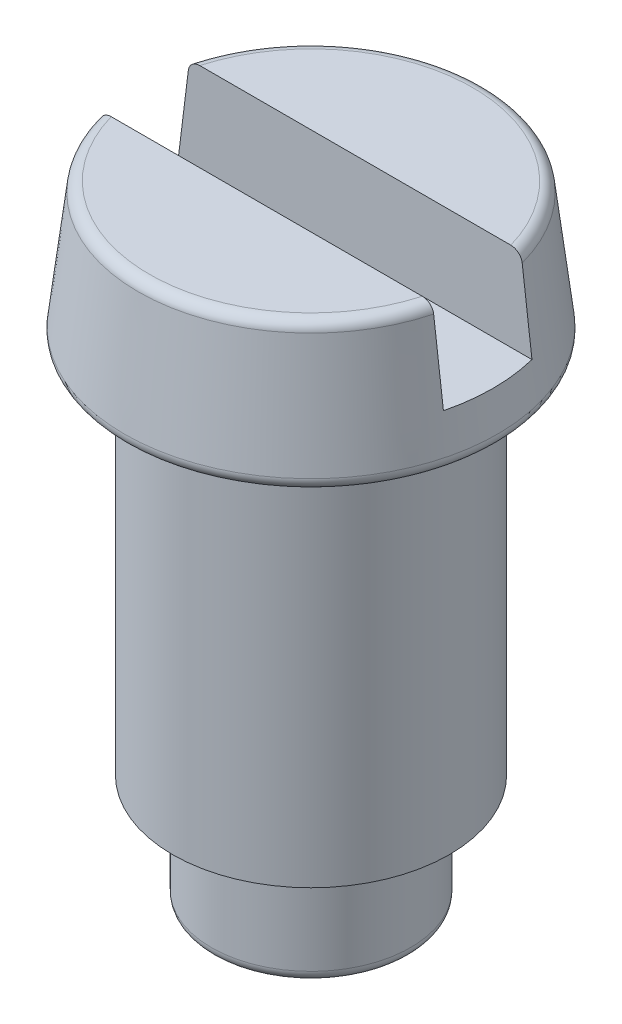
ISO-10303-21;
HEADER;
FILE_DESCRIPTION(('STEP AP214'),'2;1');
FILE_NAME('part.step','',(''),(''),'','','');
FILE_SCHEMA(('AUTOMOTIVE_DESIGN { 1 0 10303 214 1 1 1 1 }'));
ENDSEC;
DATA;
#1=APPLICATION_CONTEXT('core data for automotive mechanical design processes');
#2=APPLICATION_PROTOCOL_DEFINITION('international standard','automotive_design',2000,#1);
#3=PRODUCT_CONTEXT('',#1,'mechanical');
#4=PRODUCT('Part','Part','',(#3));
#5=PRODUCT_RELATED_PRODUCT_CATEGORY('part','',(#4));
#6=PRODUCT_DEFINITION_FORMATION('','',#4);
#7=PRODUCT_DEFINITION_CONTEXT('part definition',#1,'design');
#8=PRODUCT_DEFINITION('design','',#6,#7);
#9=PRODUCT_DEFINITION_SHAPE('','',#8);
#10=(LENGTH_UNIT() NAMED_UNIT(*) SI_UNIT(.MILLI.,.METRE.));
#11=(NAMED_UNIT(*) PLANE_ANGLE_UNIT() SI_UNIT($,.RADIAN.));
#12=(NAMED_UNIT(*) SI_UNIT($,.STERADIAN.) SOLID_ANGLE_UNIT());
#13=UNCERTAINTY_MEASURE_WITH_UNIT(LENGTH_MEASURE(1.E-05),#10,'distance_accuracy_value','');
#14=(GEOMETRIC_REPRESENTATION_CONTEXT(3) GLOBAL_UNCERTAINTY_ASSIGNED_CONTEXT((#13)) GLOBAL_UNIT_ASSIGNED_CONTEXT((#10,
#11,#12)) REPRESENTATION_CONTEXT('',''));
#15=CARTESIAN_POINT('',(0.,0.,0.));
#16=DIRECTION('',(0.,0.,1.));
#17=DIRECTION('',(1.,0.,0.));
#18=AXIS2_PLACEMENT_3D('',#15,#16,#17);
#19=CARTESIAN_POINT('',(0.,4.85,0.));
#20=DIRECTION('',(0.,-1.,0.));
#21=DIRECTION('',(0.,0.,-1.));
#22=AXIS2_PLACEMENT_3D('',#19,#20,#21);
#23=PLANE('',#22);
#24=CARTESIAN_POINT('',(0.,4.84999999997626,0.));
#25=DIRECTION('',(0.,-1.,0.));
#26=DIRECTION('',(0.,0.,-1.));
#27=AXIS2_PLACEMENT_3D('',#24,#25,#26);
#28=CIRCLE('',#27,1.64600000000177);
#29=CARTESIAN_POINT('',(-1.59665775919641,4.8499999999857,0.4));
#30=VERTEX_POINT('',#29);
#31=CARTESIAN_POINT('',(-1.59665775919611,4.84999999998813,-0.4));
#32=VERTEX_POINT('',#31);
#33=EDGE_CURVE('E98',#30,#32,#28,.T.);
#34=ORIENTED_EDGE('',*,*,#33,.F.);
#35=DIRECTION('',(1.,0.,0.));
#36=VECTOR('',#35,1.);
#37=CARTESIAN_POINT('',(-1.768147519559,4.85,0.4));
#38=LINE('',#37,#36);
#39=CARTESIAN_POINT('',(1.59665775919611,4.84999999998813,0.4));
#40=VERTEX_POINT('',#39);
#41=EDGE_CURVE('E96',#30,#40,#38,.T.);
#42=ORIENTED_EDGE('',*,*,#41,.T.);
#43=CARTESIAN_POINT('',(0.,4.84999999997626,0.));
#44=DIRECTION('',(0.,-1.,0.));
#45=DIRECTION('',(0.,0.,-1.));
#46=AXIS2_PLACEMENT_3D('',#43,#44,#45);
#47=CIRCLE('',#46,1.64600000000177);
#48=CARTESIAN_POINT('',(1.59665775919641,4.8499999999857,-0.4));
#49=VERTEX_POINT('',#48);
#50=EDGE_CURVE('E19',#49,#40,#47,.T.);
#51=ORIENTED_EDGE('',*,*,#50,.F.);
#52=DIRECTION('',(-1.,0.,0.));
#53=VECTOR('',#52,1.);
#54=CARTESIAN_POINT('',(-1.768147519559,4.85,-0.4));
#55=LINE('',#54,#53);
#56=EDGE_CURVE('E88',#49,#32,#55,.T.);
#57=ORIENTED_EDGE('',*,*,#56,.T.);
#58=EDGE_LOOP('',(#34,#42,#51,#57));
#59=FACE_BOUND('',#58,.T.);
#60=ADVANCED_FACE('F16',(#59),#23,.F.);
#61=CARTESIAN_POINT('',(-1.768147519559,4.85,-0.4));
#62=DIRECTION('',(0.,0.,-1.));
#63=DIRECTION('',(-1.,0.,0.));
#64=AXIS2_PLACEMENT_3D('',#61,#62,#63);
#65=PLANE('',#64);
#66=CARTESIAN_POINT('',(1.5084361200041,5.56191452205894,-0.4));
#67=CARTESIAN_POINT('',(1.52316535532603,5.4432652776401,-0.4));
#68=CARTESIAN_POINT('',(1.53788177625521,5.32461444524026,-0.4));
#69=CARTESIAN_POINT('',(1.56728898931891,5.08730960455233,-0.4));
#70=CARTESIAN_POINT('',(1.58197978145345,4.96865559626424,-0.4));
#71=CARTESIAN_POINT('',(1.59665775919524,4.84999999999515,-0.4));
#72=B_SPLINE_CURVE_WITH_KNOTS('',3,(#66,#67,#68,#69,#70,#71),.UNSPECIFIED.,.F.,.F.,(4,2,4),(0.,
0.358679993402551,0.717359986582176),.UNSPECIFIED.);
#73=CARTESIAN_POINT('',(1.50843612000506,5.56191452205329,-0.4));
#74=VERTEX_POINT('',#73);
#75=EDGE_CURVE('E79',#74,#49,#72,.T.);
#76=ORIENTED_EDGE('',*,*,#75,.F.);
#77=CARTESIAN_POINT('',(1.40547029837921,5.65,-0.4));
#78=CARTESIAN_POINT('',(1.41147922968689,5.64999822856031,-0.400000000000154));
#79=CARTESIAN_POINT('',(1.41747791170112,5.64949739913765,-0.400000000000156));
#80=CARTESIAN_POINT('',(1.4293114630653,5.64750523172282,-0.399999999999844));
#81=CARTESIAN_POINT('',(1.43514623903793,5.64601334059016,-0.399999999999529));
#82=CARTESIAN_POINT('',(1.45214451965364,5.64007550016679,-0.399999999998095));
#83=CARTESIAN_POINT('',(1.46284061760868,5.63416725771965,-0.399999999996488));
#84=CARTESIAN_POINT('',(1.48133936764325,5.61920015614898,-0.399999999994457));
#85=CARTESIAN_POINT('',(1.48919823231907,5.61021029812244,-0.399999999994009));
#86=CARTESIAN_POINT('',(1.50107820419689,5.59035966043989,-0.399999999989531));
#87=CARTESIAN_POINT('',(1.50522507473134,5.57957619011118,-0.399999999985627));
#88=CARTESIAN_POINT('',(1.50781693035836,5.56629862848649,-0.39999999999533));
#89=CARTESIAN_POINT('',(1.50816568266591,5.56410997100173,-0.399999999997382));
#90=CARTESIAN_POINT('',(1.50843612000461,5.561914522059,-0.4));
#91=B_SPLINE_CURVE_WITH_KNOTS('',3,(#77,#78,#79,#80,#81,#82,#83,#84,#85,#86,#87,#88,#89,#90),
.UNSPECIFIED.,.F.,.F.,(4,2,2,2,2,2,4),(0.,0.0179852639778331,0.035980574499926,
0.0718609112141041,0.106985305493597,0.140868916868276,0.147512026187207),.UNSPECIFIED.);
#92=CARTESIAN_POINT('',(1.40547029837921,5.65,-0.4));
#93=VERTEX_POINT('',#92);
#94=EDGE_CURVE('E89',#93,#74,#91,.T.);
#95=ORIENTED_EDGE('',*,*,#94,.F.);
#96=DIRECTION('',(1.,0.,0.));
#97=VECTOR('',#96,1.);
#98=CARTESIAN_POINT('',(1.46128257350389,5.65,-0.4));
#99=LINE('',#98,#97);
#100=CARTESIAN_POINT('',(-1.40547029837921,5.65,-0.4));
#101=VERTEX_POINT('',#100);
#102=EDGE_CURVE('E114',#93,#101,#99,.F.);
#103=ORIENTED_EDGE('',*,*,#102,.T.);
#104=CARTESIAN_POINT('',(-1.50843612000474,5.56191452205799,-0.4));
#105=CARTESIAN_POINT('',(-1.50775530615872,5.56740322765467,-0.400000000000333));
#106=CARTESIAN_POINT('',(-1.50660311321343,5.57282244695649,-0.400000000000224));
#107=CARTESIAN_POINT('',(-1.50340486766833,5.58337971326032,-0.399999999999777));
#108=CARTESIAN_POINT('',(-1.50136045159706,5.58851825575903,-0.399999999999441));
#109=CARTESIAN_POINT('',(-1.49397215324613,5.60329708616507,-0.399999999999075));
#110=CARTESIAN_POINT('',(-1.4873679954098,5.612339254105,-0.399999999999683));
#111=CARTESIAN_POINT('',(-1.47149764779081,5.62795211561759,-0.400000000000188));
#112=CARTESIAN_POINT('',(-1.46218497140173,5.63447457265853,-0.400000000000074));
#113=CARTESIAN_POINT('',(-1.44161830855278,5.64442084936092,-0.399999999999922));
#114=CARTESIAN_POINT('',(-1.43030885430376,5.64773115510223,-0.399999999999889));
#115=CARTESIAN_POINT('',(-1.41437934387082,5.6497284635288,-0.399999999999939));
#116=CARTESIAN_POINT('',(-1.40991978939713,5.65000652448436,-0.399999999999964));
#117=CARTESIAN_POINT('',(-1.40547029837921,5.65,-0.4));
#118=B_SPLINE_CURVE_WITH_KNOTS('',3,(#104,#105,#106,#107,#108,#109,#110,#111,#112,#113,#114,
#115,#116,#117),.UNSPECIFIED.,.F.,.F.,(4,2,2,2,2,2,4),(0.,0.0165514483714113,0.0330726646001638,
0.0660037881696575,0.0995373212014563,0.134216864714849,0.147583082705096),.UNSPECIFIED.);
#119=CARTESIAN_POINT('',(-1.50843612000486,5.56191452205275,-0.4));
#120=VERTEX_POINT('',#119);
#121=EDGE_CURVE('E206',#120,#101,#118,.T.);
#122=ORIENTED_EDGE('',*,*,#121,.F.);
#123=CARTESIAN_POINT('',(-1.59665775919524,4.84999999999515,-0.4));
#124=CARTESIAN_POINT('',(-1.58197978145347,4.96865559626407,-0.4));
#125=CARTESIAN_POINT('',(-1.56728898931895,5.08730960455199,-0.4));
#126=CARTESIAN_POINT('',(-1.5378817762553,5.32461444523959,-0.4));
#127=CARTESIAN_POINT('',(-1.52316535532614,5.44326527763926,-0.4));
#128=CARTESIAN_POINT('',(-1.50843612000422,5.56191452205793,-0.4));
#129=B_SPLINE_CURVE_WITH_KNOTS('',3,(#123,#124,#125,#126,#127,#128),.UNSPECIFIED.,.F.,.F.,(4,2,
4),(0.,0.358679993179117,0.717359986581159),.UNSPECIFIED.);
#130=EDGE_CURVE('E101',#32,#120,#129,.T.);
#131=ORIENTED_EDGE('',*,*,#130,.F.);
#132=ORIENTED_EDGE('',*,*,#56,.F.);
#133=EDGE_LOOP('',(#76,#95,#103,#122,#131,#132));
#134=FACE_BOUND('',#133,.T.);
#135=ADVANCED_FACE('F99',(#134),#65,.F.);
#136=CARTESIAN_POINT('',(-1.768147519559,4.85,0.4));
#137=DIRECTION('',(0.,0.,1.));
#138=DIRECTION('',(1.,0.,0.));
#139=AXIS2_PLACEMENT_3D('',#136,#137,#138);
#140=PLANE('',#139);
#141=DIRECTION('',(1.,0.,0.));
#142=VECTOR('',#141,1.);
#143=CARTESIAN_POINT('',(1.46128257350389,5.65,0.4));
#144=LINE('',#143,#142);
#145=CARTESIAN_POINT('',(-1.40547029837921,5.65,0.4));
#146=VERTEX_POINT('',#145);
#147=CARTESIAN_POINT('',(1.40547029837921,5.65,0.4));
#148=VERTEX_POINT('',#147);
#149=EDGE_CURVE('E167',#146,#148,#144,.T.);
#150=ORIENTED_EDGE('',*,*,#149,.T.);
#151=CARTESIAN_POINT('',(1.50843612000496,5.56191452205618,0.4));
#152=CARTESIAN_POINT('',(1.50775530615905,5.56740322765286,0.400000000000333));
#153=CARTESIAN_POINT('',(1.50660311321386,5.57282244695469,0.400000000000223));
#154=CARTESIAN_POINT('',(1.50340486766897,5.58337971325857,0.399999999999777));
#155=CARTESIAN_POINT('',(1.5013604515978,5.58851825575732,0.399999999999441));
#156=CARTESIAN_POINT('',(1.49397215324715,5.60329708616348,0.399999999999075));
#157=CARTESIAN_POINT('',(1.487367995411,5.61233925410353,0.399999999999682));
#158=CARTESIAN_POINT('',(1.47149764779233,5.62795211561639,0.400000000000188));
#159=CARTESIAN_POINT('',(1.46218497140339,5.63447457265749,0.400000000000073));
#160=CARTESIAN_POINT('',(1.44161830855466,5.64442084936025,0.399999999999922));
#161=CARTESIAN_POINT('',(1.43030885430573,5.64773115510177,0.399999999999889));
#162=CARTESIAN_POINT('',(1.41437934387217,5.64972846352872,0.399999999999939));
#163=CARTESIAN_POINT('',(1.40991978939781,5.65000652448436,0.399999999999964));
#164=CARTESIAN_POINT('',(1.40547029837921,5.65,0.4));
#165=B_SPLINE_CURVE_WITH_KNOTS('',3,(#151,#152,#153,#154,#155,#156,#157,#158,#159,#160,#161,
#162,#163,#164),.UNSPECIFIED.,.F.,.F.,(4,2,2,2,2,2,4),(0.,0.0165514483713908,0.0330726646001252,
0.0660037881695804,0.0995373212013209,0.134216864714645,0.147583082706921),.UNSPECIFIED.);
#166=CARTESIAN_POINT('',(1.50843612000498,5.56191452205184,0.4));
#167=VERTEX_POINT('',#166);
#168=EDGE_CURVE('E115',#167,#148,#165,.T.);
#169=ORIENTED_EDGE('',*,*,#168,.F.);
#170=CARTESIAN_POINT('',(1.59665775919525,4.84999999999505,0.4));
#171=CARTESIAN_POINT('',(1.58197978145351,4.96865559626369,0.4));
#172=CARTESIAN_POINT('',(1.56728898931903,5.08730960455132,0.4));
#173=CARTESIAN_POINT('',(1.53788177625545,5.32461444523835,0.4));
#174=CARTESIAN_POINT('',(1.52316535532633,5.44326527763773,0.4));
#175=CARTESIAN_POINT('',(1.50843612000445,5.56191452205611,0.4));
#176=B_SPLINE_CURVE_WITH_KNOTS('',3,(#170,#171,#172,#173,#174,#175),.UNSPECIFIED.,.F.,.F.,(4,2,
4),(0.,0.358679993178251,0.717359986579427),.UNSPECIFIED.);
#177=EDGE_CURVE('E222',#40,#167,#176,.T.);
#178=ORIENTED_EDGE('',*,*,#177,.F.);
#179=ORIENTED_EDGE('',*,*,#41,.F.);
#180=CARTESIAN_POINT('',(-1.5084361200041,5.56191452205894,0.4));
#181=CARTESIAN_POINT('',(-1.52316535532603,5.4432652776401,0.4));
#182=CARTESIAN_POINT('',(-1.53788177625521,5.32461444524026,0.4));
#183=CARTESIAN_POINT('',(-1.56728898931891,5.08730960455233,0.4));
#184=CARTESIAN_POINT('',(-1.58197978145345,4.96865559626424,0.4));
#185=CARTESIAN_POINT('',(-1.59665775919524,4.84999999999515,0.4));
#186=B_SPLINE_CURVE_WITH_KNOTS('',3,(#180,#181,#182,#183,#184,#185),.UNSPECIFIED.,.F.,.F.,(4,2,
4),(0.,0.358679993402551,0.717359986582176),.UNSPECIFIED.);
#187=CARTESIAN_POINT('',(-1.50843612000506,5.56191452205329,0.400000000000001));
#188=VERTEX_POINT('',#187);
#189=EDGE_CURVE('E102',#188,#30,#186,.T.);
#190=ORIENTED_EDGE('',*,*,#189,.F.);
#191=CARTESIAN_POINT('',(-1.40547029837921,5.65,0.400000000000001));
#192=CARTESIAN_POINT('',(-1.41147922968689,5.64999822856031,0.400000000000155));
#193=CARTESIAN_POINT('',(-1.41747791170112,5.64949739913765,0.400000000000157));
#194=CARTESIAN_POINT('',(-1.4293114630653,5.64750523172282,0.399999999999843));
#195=CARTESIAN_POINT('',(-1.43514623903793,5.64601334059016,0.399999999999528));
#196=CARTESIAN_POINT('',(-1.45214451965364,5.64007550016679,0.399999999998094));
#197=CARTESIAN_POINT('',(-1.46284061760868,5.63416725771965,0.399999999996486));
#198=CARTESIAN_POINT('',(-1.48133936764325,5.61920015614898,0.399999999994457));
#199=CARTESIAN_POINT('',(-1.48919823231906,5.61021029812244,0.399999999994012));
#200=CARTESIAN_POINT('',(-1.50107820419689,5.59035966043989,0.399999999989531));
#201=CARTESIAN_POINT('',(-1.50522507473134,5.57957619011118,0.399999999985623));
#202=CARTESIAN_POINT('',(-1.50781693035836,5.56629862848649,0.399999999995329));
#203=CARTESIAN_POINT('',(-1.50816568266591,5.56410997100173,0.399999999997383));
#204=CARTESIAN_POINT('',(-1.50843612000461,5.561914522059,0.400000000000002));
#205=B_SPLINE_CURVE_WITH_KNOTS('',3,(#191,#192,#193,#194,#195,#196,#197,#198,#199,#200,#201,
#202,#203,#204),.UNSPECIFIED.,.F.,.F.,(4,2,2,2,2,2,4),(0.,0.0179852639778329,0.0359805744999262,
0.0718609112141045,0.106985305493597,0.140868916868276,0.147512026187207),.UNSPECIFIED.);
#206=EDGE_CURVE('E111',#146,#188,#205,.T.);
#207=ORIENTED_EDGE('',*,*,#206,.F.);
#208=EDGE_LOOP('',(#150,#169,#178,#179,#190,#207));
#209=FACE_BOUND('',#208,.T.);
#210=ADVANCED_FACE('F124',(#209),#140,.F.);
#211=CARTESIAN_POINT('',(1.46128257350389,5.65,0.));
#212=DIRECTION('',(0.,-1.,0.));
#213=DIRECTION('',(0.,0.,-1.));
#214=AXIS2_PLACEMENT_3D('',#211,#212,#213);
#215=PLANE('',#214);
#216=ORIENTED_EDGE('',*,*,#102,.F.);
#217=CARTESIAN_POINT('',(0.,5.65,0.));
#218=DIRECTION('',(0.,-1.,0.));
#219=DIRECTION('',(-0.961805966801581,0.,-0.273732135900912));
#220=AXIS2_PLACEMENT_3D('',#217,#218,#219);
#221=CIRCLE('',#220,1.46128257350389);
#222=EDGE_CURVE('E198',#101,#93,#221,.T.);
#223=ORIENTED_EDGE('',*,*,#222,.F.);
#224=EDGE_LOOP('',(#216,#223));
#225=FACE_BOUND('',#224,.T.);
#226=ADVANCED_FACE('F177',(#225),#215,.F.);
#227=CARTESIAN_POINT('',(1.46128257350389,5.65,0.));
#228=DIRECTION('',(0.,-1.,0.));
#229=DIRECTION('',(0.,0.,-1.));
#230=AXIS2_PLACEMENT_3D('',#227,#228,#229);
#231=PLANE('',#230);
#232=ORIENTED_EDGE('',*,*,#149,.F.);
#233=CARTESIAN_POINT('',(0.,5.65,0.));
#234=DIRECTION('',(0.,-1.,0.));
#235=DIRECTION('',(0.961805966801582,0.,0.273732135900912));
#236=AXIS2_PLACEMENT_3D('',#233,#234,#235);
#237=CIRCLE('',#236,1.46128257350389);
#238=EDGE_CURVE('E158',#148,#146,#237,.T.);
#239=ORIENTED_EDGE('',*,*,#238,.F.);
#240=EDGE_LOOP('',(#232,#239));
#241=FACE_BOUND('',#240,.T.);
#242=ADVANCED_FACE('F169',(#241),#231,.F.);
#243=CARTESIAN_POINT('',(0.,5.55,0.));
#244=DIRECTION('',(0.,1.,0.));
#245=DIRECTION('',(-6.90436256636933E-13,0.,-1.));
#246=AXIS2_PLACEMENT_3D('',#243,#244,#245);
#247=TOROIDAL_SURFACE('',#246,1.46128257350389,0.1);
#248=ORIENTED_EDGE('',*,*,#222,.T.);
#249=ORIENTED_EDGE('',*,*,#94,.T.);
#250=CARTESIAN_POINT('',(0.,5.56191452204757,0.));
#251=DIRECTION('',(0.,-1.,0.));
#252=DIRECTION('',(0.,0.,-1.));
#253=AXIS2_PLACEMENT_3D('',#250,#251,#252);
#254=CIRCLE('',#253,1.56057025735379);
#255=EDGE_CURVE('E85',#120,#74,#254,.T.);
#256=ORIENTED_EDGE('',*,*,#255,.F.);
#257=ORIENTED_EDGE('',*,*,#121,.T.);
#258=EDGE_LOOP('',(#248,#249,#256,#257));
#259=FACE_BOUND('',#258,.T.);
#260=ADVANCED_FACE('F134',(#259),#247,.T.);
#261=CARTESIAN_POINT('',(0.,5.55,0.));
#262=DIRECTION('',(0.,1.,0.));
#263=DIRECTION('',(0.,0.,1.));
#264=AXIS2_PLACEMENT_3D('',#261,#262,#263);
#265=TOROIDAL_SURFACE('',#264,1.46128257350389,0.1);
#266=ORIENTED_EDGE('',*,*,#238,.T.);
#267=ORIENTED_EDGE('',*,*,#206,.T.);
#268=CARTESIAN_POINT('',(0.,5.56191452204757,0.));
#269=DIRECTION('',(0.,-1.,0.));
#270=DIRECTION('',(0.,0.,-1.));
#271=AXIS2_PLACEMENT_3D('',#268,#269,#270);
#272=CIRCLE('',#271,1.56057025735379);
#273=EDGE_CURVE('E151',#167,#188,#272,.T.);
#274=ORIENTED_EDGE('',*,*,#273,.F.);
#275=ORIENTED_EDGE('',*,*,#168,.T.);
#276=EDGE_LOOP('',(#266,#267,#274,#275));
#277=FACE_BOUND('',#276,.T.);
#278=ADVANCED_FACE('F127',(#277),#265,.T.);
#279=CARTESIAN_POINT('',(0.,0.,0.));
#280=DIRECTION('',(0.,1.,0.));
#281=DIRECTION('',(0.,0.,1.));
#282=AXIS2_PLACEMENT_3D('',#279,#280,#281);
#283=PLANE('',#282);
#284=CARTESIAN_POINT('',(0.,0.,0.));
#285=DIRECTION('',(0.,1.,0.));
#286=DIRECTION('',(0.,0.,-1.));
#287=AXIS2_PLACEMENT_3D('',#284,#285,#286);
#288=CIRCLE('',#287,0.8);
#289=CARTESIAN_POINT('',(0.,0.,-0.8));
#290=VERTEX_POINT('',#289);
#291=CARTESIAN_POINT('',(0.,0.,0.8));
#292=VERTEX_POINT('',#291);
#293=EDGE_CURVE('E153',#290,#292,#288,.T.);
#294=ORIENTED_EDGE('',*,*,#293,.F.);
#295=CARTESIAN_POINT('',(0.,0.,0.));
#296=DIRECTION('',(0.,1.,0.));
#297=DIRECTION('',(0.,0.,1.));
#298=AXIS2_PLACEMENT_3D('',#295,#296,#297);
#299=CIRCLE('',#298,0.8);
#300=EDGE_CURVE('E342',#292,#290,#299,.T.);
#301=ORIENTED_EDGE('',*,*,#300,.F.);
#302=EDGE_LOOP('',(#294,#301));
#303=FACE_BOUND('',#302,.T.);
#304=ADVANCED_FACE('F133',(#303),#283,.F.);
#305=CARTESIAN_POINT('',(0.,4.51191452202693,0.));
#306=DIRECTION('',(0.,-1.,0.));
#307=DIRECTION('',(0.,0.,-1.));
#308=AXIS2_PLACEMENT_3D('',#305,#306,#307);
#309=CONICAL_SURFACE('',#308,1.68657025735541,0.119428926017538);
#310=ORIENTED_EDGE('',*,*,#273,.T.);
#311=ORIENTED_EDGE('',*,*,#189,.T.);
#312=ORIENTED_EDGE('',*,*,#33,.T.);
#313=ORIENTED_EDGE('',*,*,#130,.T.);
#314=ORIENTED_EDGE('',*,*,#255,.T.);
#315=ORIENTED_EDGE('',*,*,#75,.T.);
#316=ORIENTED_EDGE('',*,*,#50,.T.);
#317=ORIENTED_EDGE('',*,*,#177,.T.);
#318=EDGE_LOOP('',(#310,#311,#312,#313,#314,#315,#316,#317));
#319=FACE_BOUND('',#318,.T.);
#320=CARTESIAN_POINT('',(0.,4.51191452206184,0.));
#321=DIRECTION('',(0.,1.,0.));
#322=DIRECTION('',(0.,0.,1.));
#323=AXIS2_PLACEMENT_3D('',#320,#321,#322);
#324=CIRCLE('',#323,1.68657025735258);
#325=CARTESIAN_POINT('',(0.,4.51191452206184,1.68657025735258));
#326=VERTEX_POINT('',#325);
#327=EDGE_CURVE('E308',#326,#326,#324,.F.);
#328=ORIENTED_EDGE('',*,*,#327,.F.);
#329=EDGE_LOOP('',(#328));
#330=FACE_BOUND('',#329,.T.);
#331=ADVANCED_FACE('F81',(#319,#330),#309,.T.);
#332=CARTESIAN_POINT('',(0.,0.1,0.));
#333=DIRECTION('',(0.,1.,0.));
#334=DIRECTION('',(0.,0.,1.));
#335=AXIS2_PLACEMENT_3D('',#332,#333,#334);
#336=TOROIDAL_SURFACE('',#335,0.800000000000001,0.1);
#337=ORIENTED_EDGE('',*,*,#300,.T.);
#338=ORIENTED_EDGE('',*,*,#293,.T.);
#339=EDGE_LOOP('',(#337,#338));
#340=FACE_BOUND('',#339,.T.);
#341=CARTESIAN_POINT('',(0.,0.1,0.));
#342=DIRECTION('',(0.,1.,0.));
#343=DIRECTION('',(0.,0.,1.));
#344=AXIS2_PLACEMENT_3D('',#341,#342,#343);
#345=CIRCLE('',#344,0.900000000000001);
#346=CARTESIAN_POINT('',(0.,0.1,0.900000000000001));
#347=VERTEX_POINT('',#346);
#348=EDGE_CURVE('E300',#347,#347,#345,.T.);
#349=ORIENTED_EDGE('',*,*,#348,.F.);
#350=EDGE_LOOP('',(#349));
#351=FACE_BOUND('',#350,.T.);
#352=ADVANCED_FACE('F236',(#340,#351),#336,.T.);
#353=CARTESIAN_POINT('',(0.,4.5,0.));
#354=DIRECTION('',(0.,1.,0.));
#355=DIRECTION('',(0.,0.,1.));
#356=AXIS2_PLACEMENT_3D('',#353,#354,#355);
#357=TOROIDAL_SURFACE('',#356,1.58728257350389,0.1);
#358=CARTESIAN_POINT('',(0.,4.4,0.));
#359=DIRECTION('',(0.,1.,0.));
#360=DIRECTION('',(0.,0.,1.));
#361=AXIS2_PLACEMENT_3D('',#358,#359,#360);
#362=CIRCLE('',#361,1.58728257350389);
#363=CARTESIAN_POINT('',(0.,4.4,1.58728257350389));
#364=VERTEX_POINT('',#363);
#365=CARTESIAN_POINT('',(0.,4.4,-1.58728257350389));
#366=VERTEX_POINT('',#365);
#367=EDGE_CURVE('E313',#364,#366,#362,.T.);
#368=ORIENTED_EDGE('',*,*,#367,.T.);
#369=CARTESIAN_POINT('',(0.,4.4,0.));
#370=DIRECTION('',(0.,1.,0.));
#371=DIRECTION('',(0.,0.,-1.));
#372=AXIS2_PLACEMENT_3D('',#369,#370,#371);
#373=CIRCLE('',#372,1.58728257350389);
#374=EDGE_CURVE('E33',#366,#364,#373,.T.);
#375=ORIENTED_EDGE('',*,*,#374,.T.);
#376=EDGE_LOOP('',(#368,#375));
#377=FACE_BOUND('',#376,.T.);
#378=ORIENTED_EDGE('',*,*,#327,.T.);
#379=EDGE_LOOP('',(#378));
#380=FACE_BOUND('',#379,.T.);
#381=ADVANCED_FACE('F319',(#377,#380),#357,.T.);
#382=CARTESIAN_POINT('',(0.,7.19908490119925,0.));
#383=DIRECTION('',(0.,1.,0.));
#384=DIRECTION('',(0.,0.,1.));
#385=AXIS2_PLACEMENT_3D('',#382,#383,#384);
#386=CYLINDRICAL_SURFACE('',#385,0.900000000000001);
#387=ORIENTED_EDGE('',*,*,#348,.T.);
#388=EDGE_LOOP('',(#387));
#389=FACE_BOUND('',#388,.T.);
#390=CARTESIAN_POINT('',(0.,0.800000000026557,0.));
#391=DIRECTION('',(0.,1.,0.));
#392=DIRECTION('',(0.,0.,1.));
#393=AXIS2_PLACEMENT_3D('',#390,#391,#392);
#394=CIRCLE('',#393,0.900000000001455);
#395=CARTESIAN_POINT('',(0.,0.800000000026557,0.900000000001455));
#396=VERTEX_POINT('',#395);
#397=EDGE_CURVE('E110',#396,#396,#394,.T.);
#398=ORIENTED_EDGE('',*,*,#397,.F.);
#399=EDGE_LOOP('',(#398));
#400=FACE_BOUND('',#399,.T.);
#401=ADVANCED_FACE('F288',(#389,#400),#386,.T.);
#402=CARTESIAN_POINT('',(1.25,4.4,0.));
#403=DIRECTION('',(0.,1.,0.));
#404=DIRECTION('',(0.,0.,1.));
#405=AXIS2_PLACEMENT_3D('',#402,#403,#404);
#406=PLANE('',#405);
#407=CARTESIAN_POINT('',(0.,4.4,0.));
#408=DIRECTION('',(0.,1.,0.));
#409=DIRECTION('',(0.,0.,1.));
#410=AXIS2_PLACEMENT_3D('',#407,#408,#409);
#411=CIRCLE('',#410,1.25);
#412=CARTESIAN_POINT('',(0.,4.4,1.25));
#413=VERTEX_POINT('',#412);
#414=EDGE_CURVE('E25',#413,#413,#411,.F.);
#415=ORIENTED_EDGE('',*,*,#414,.F.);
#416=EDGE_LOOP('',(#415));
#417=FACE_BOUND('',#416,.T.);
#418=ORIENTED_EDGE('',*,*,#374,.F.);
#419=ORIENTED_EDGE('',*,*,#367,.F.);
#420=EDGE_LOOP('',(#418,#419));
#421=FACE_BOUND('',#420,.T.);
#422=ADVANCED_FACE('F280',(#417,#421),#406,.F.);
#423=CARTESIAN_POINT('',(0.,1.0020725941331,0.));
#424=DIRECTION('',(0.,1.,0.));
#425=DIRECTION('',(0.,0.,1.));
#426=AXIS2_PLACEMENT_3D('',#423,#424,#425);
#427=CONICAL_SURFACE('',#426,1.24999999979991,1.04719755114996);
#428=ORIENTED_EDGE('',*,*,#397,.T.);
#429=EDGE_LOOP('',(#428));
#430=FACE_BOUND('',#429,.T.);
#431=CARTESIAN_POINT('',(0.,1.00207259421637,0.));
#432=DIRECTION('',(0.,1.,0.));
#433=DIRECTION('',(0.,0.,1.));
#434=AXIS2_PLACEMENT_3D('',#431,#432,#433);
#435=CIRCLE('',#434,1.25);
#436=CARTESIAN_POINT('',(0.,1.00207259421637,1.25));
#437=VERTEX_POINT('',#436);
#438=EDGE_CURVE('E11',#437,#437,#435,.T.);
#439=ORIENTED_EDGE('',*,*,#438,.F.);
#440=EDGE_LOOP('',(#439));
#441=FACE_BOUND('',#440,.T.);
#442=ADVANCED_FACE('F274',(#430,#441),#427,.T.);
#443=CARTESIAN_POINT('',(0.,7.19908490119925,0.));
#444=DIRECTION('',(0.,1.,0.));
#445=DIRECTION('',(0.,0.,1.));
#446=AXIS2_PLACEMENT_3D('',#443,#444,#445);
#447=CYLINDRICAL_SURFACE('',#446,1.25);
#448=ORIENTED_EDGE('',*,*,#438,.T.);
#449=EDGE_LOOP('',(#448));
#450=FACE_BOUND('',#449,.T.);
#451=ORIENTED_EDGE('',*,*,#414,.T.);
#452=EDGE_LOOP('',(#451));
#453=FACE_BOUND('',#452,.T.);
#454=ADVANCED_FACE('F272',(#450,#453),#447,.T.);
#455=CLOSED_SHELL('',(#60,#135,#210,#226,#242,#260,#278,#304,#331,#352,#381,#401,#422,#442,#454));
#456=MANIFOLD_SOLID_BREP('B1',#455);
#457=ADVANCED_BREP_SHAPE_REPRESENTATION('',(#18,#456),#14);
#458=SHAPE_DEFINITION_REPRESENTATION(#9,#457);
ENDSEC;
END-ISO-10303-21;
